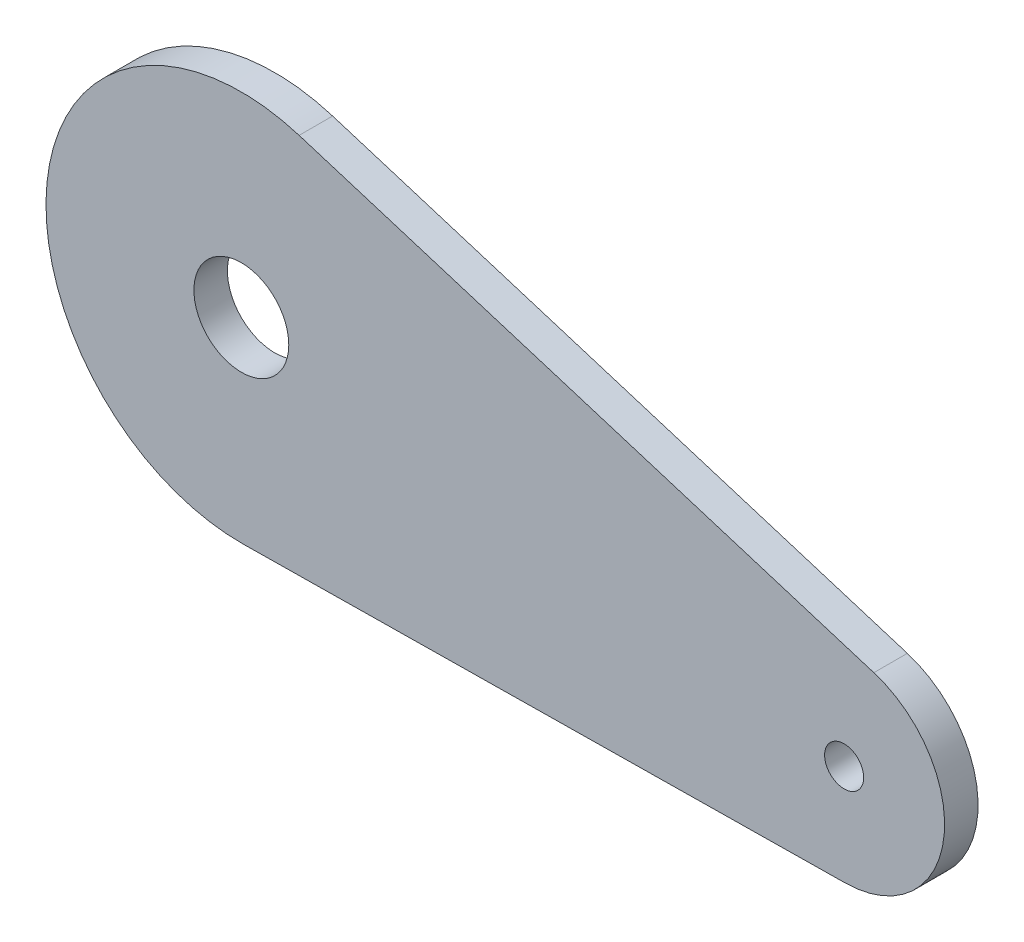
ISO-10303-21;
HEADER;
FILE_DESCRIPTION(('STEP AP214'),'2;1');
FILE_NAME('part.step','',(''),(''),'','','');
FILE_SCHEMA(('AUTOMOTIVE_DESIGN { 1 0 10303 214 1 1 1 1 }'));
ENDSEC;
DATA;
#1=APPLICATION_CONTEXT('core data for automotive mechanical design processes');
#2=APPLICATION_PROTOCOL_DEFINITION('international standard','automotive_design',2000,#1);
#3=PRODUCT_CONTEXT('',#1,'mechanical');
#4=PRODUCT('Part','Part','',(#3));
#5=PRODUCT_RELATED_PRODUCT_CATEGORY('part','',(#4));
#6=PRODUCT_DEFINITION_FORMATION('','',#4);
#7=PRODUCT_DEFINITION_CONTEXT('part definition',#1,'design');
#8=PRODUCT_DEFINITION('design','',#6,#7);
#9=PRODUCT_DEFINITION_SHAPE('','',#8);
#10=(LENGTH_UNIT() NAMED_UNIT(*) SI_UNIT(.MILLI.,.METRE.));
#11=(NAMED_UNIT(*) PLANE_ANGLE_UNIT() SI_UNIT($,.RADIAN.));
#12=(NAMED_UNIT(*) SI_UNIT($,.STERADIAN.) SOLID_ANGLE_UNIT());
#13=UNCERTAINTY_MEASURE_WITH_UNIT(LENGTH_MEASURE(1.E-05),#10,'distance_accuracy_value','');
#14=(GEOMETRIC_REPRESENTATION_CONTEXT(3) GLOBAL_UNCERTAINTY_ASSIGNED_CONTEXT((#13)) GLOBAL_UNIT_ASSIGNED_CONTEXT((#10,
#11,#12)) REPRESENTATION_CONTEXT('',''));
#15=CARTESIAN_POINT('',(0.,0.,0.));
#16=DIRECTION('',(0.,0.,1.));
#17=DIRECTION('',(1.,0.,0.));
#18=AXIS2_PLACEMENT_3D('',#15,#16,#17);
#19=CARTESIAN_POINT('',(-20.22,57.58,3.));
#20=DIRECTION('',(0.,0.,-1.));
#21=DIRECTION('',(-1.,0.,0.));
#22=AXIS2_PLACEMENT_3D('',#19,#20,#21);
#23=PLANE('',#22);
#24=CARTESIAN_POINT('',(-20.22,57.58,3.));
#25=DIRECTION('',(0.,0.,1.));
#26=DIRECTION('',(-1.,0.,0.));
#27=AXIS2_PLACEMENT_3D('',#24,#25,#26);
#28=CIRCLE('',#27,17.5);
#29=CARTESIAN_POINT('',(-15.0436132313808,74.2969082076102,3.));
#30=VERTEX_POINT('',#29);
#31=CARTESIAN_POINT('',(-20.0003733558261,40.0813782217808,3.));
#32=VERTEX_POINT('',#31);
#33=EDGE_CURVE('E85',#30,#32,#28,.T.);
#34=ORIENTED_EDGE('',*,*,#33,.T.);
#35=DIRECTION('',(0.999921244469671,0.0125500939527941,0.));
#36=VECTOR('',#35,1.);
#37=CARTESIAN_POINT('',(33.8929508455751,40.7577977757174,3.));
#38=LINE('',#37,#36);
#39=CARTESIAN_POINT('',(33.8929508455751,40.7577977757174,3.));
#40=VERTEX_POINT('',#39);
#41=EDGE_CURVE('E80',#32,#40,#38,.T.);
#42=ORIENTED_EDGE('',*,*,#41,.T.);
#43=CARTESIAN_POINT('',(33.78,49.7570889759445,3.));
#44=DIRECTION('',(0.,0.,1.));
#45=DIRECTION('',(-1.,0.,0.));
#46=AXIS2_PLACEMENT_3D('',#43,#44,#45);
#47=CIRCLE('',#46,9.);
#48=CARTESIAN_POINT('',(36.4421417667184,58.354356054144,3.));
#49=VERTEX_POINT('',#48);
#50=EDGE_CURVE('E83',#40,#49,#47,.T.);
#51=ORIENTED_EDGE('',*,*,#50,.T.);
#52=DIRECTION('',(-0.955251897577723,0.295793529635384,0.));
#53=VECTOR('',#52,1.);
#54=CARTESIAN_POINT('',(-15.0436132313808,74.2969082076102,3.));
#55=LINE('',#54,#53);
#56=EDGE_CURVE('E50',#49,#30,#55,.T.);
#57=ORIENTED_EDGE('',*,*,#56,.T.);
#58=EDGE_LOOP('',(#34,#42,#51,#57));
#59=FACE_BOUND('',#58,.T.);
#60=CARTESIAN_POINT('',(-20.22,57.58,3.));
#61=DIRECTION('',(0.,0.,1.));
#62=DIRECTION('',(1.,0.,0.));
#63=AXIS2_PLACEMENT_3D('',#60,#61,#62);
#64=CIRCLE('',#63,4.25);
#65=CARTESIAN_POINT('',(-15.97,57.58,3.));
#66=VERTEX_POINT('',#65);
#67=EDGE_CURVE('E100',#66,#66,#64,.T.);
#68=ORIENTED_EDGE('',*,*,#67,.F.);
#69=EDGE_LOOP('',(#68));
#70=FACE_BOUND('',#69,.T.);
#71=CARTESIAN_POINT('',(33.78,49.7570889759445,3.));
#72=DIRECTION('',(0.,0.,1.));
#73=DIRECTION('',(1.,0.,0.));
#74=AXIS2_PLACEMENT_3D('',#71,#72,#73);
#75=CIRCLE('',#74,1.75);
#76=CARTESIAN_POINT('',(35.53,49.7570889759445,3.));
#77=VERTEX_POINT('',#76);
#78=EDGE_CURVE('E115',#77,#77,#75,.T.);
#79=ORIENTED_EDGE('',*,*,#78,.F.);
#80=EDGE_LOOP('',(#79));
#81=FACE_BOUND('',#80,.T.);
#82=ADVANCED_FACE('F33',(#59,#70,#81),#23,.F.);
#83=CARTESIAN_POINT('',(-20.22,57.58,0.));
#84=DIRECTION('',(0.,0.,-1.));
#85=DIRECTION('',(-1.,0.,0.));
#86=AXIS2_PLACEMENT_3D('',#83,#84,#85);
#87=PLANE('',#86);
#88=CARTESIAN_POINT('',(-20.22,57.58,0.));
#89=DIRECTION('',(0.,0.,1.));
#90=DIRECTION('',(1.,0.,0.));
#91=AXIS2_PLACEMENT_3D('',#88,#89,#90);
#92=CIRCLE('',#91,4.25);
#93=CARTESIAN_POINT('',(-15.97,57.58,0.));
#94=VERTEX_POINT('',#93);
#95=EDGE_CURVE('E112',#94,#94,#92,.T.);
#96=ORIENTED_EDGE('',*,*,#95,.T.);
#97=EDGE_LOOP('',(#96));
#98=FACE_BOUND('',#97,.T.);
#99=CARTESIAN_POINT('',(-20.22,57.58,0.));
#100=DIRECTION('',(0.,0.,1.));
#101=DIRECTION('',(-1.,0.,0.));
#102=AXIS2_PLACEMENT_3D('',#99,#100,#101);
#103=CIRCLE('',#102,17.5);
#104=CARTESIAN_POINT('',(-15.0436132313808,74.2969082076102,0.));
#105=VERTEX_POINT('',#104);
#106=CARTESIAN_POINT('',(-20.0003733558261,40.0813782217808,0.));
#107=VERTEX_POINT('',#106);
#108=EDGE_CURVE('E97',#105,#107,#103,.T.);
#109=ORIENTED_EDGE('',*,*,#108,.F.);
#110=DIRECTION('',(-0.955251897577723,0.295793529635384,0.));
#111=VECTOR('',#110,1.);
#112=CARTESIAN_POINT('',(-15.0436132313808,74.2969082076102,0.));
#113=LINE('',#112,#111);
#114=CARTESIAN_POINT('',(36.4421417667184,58.354356054144,0.));
#115=VERTEX_POINT('',#114);
#116=EDGE_CURVE('E73',#115,#105,#113,.T.);
#117=ORIENTED_EDGE('',*,*,#116,.F.);
#118=CARTESIAN_POINT('',(33.78,49.7570889759445,0.));
#119=DIRECTION('',(0.,0.,1.));
#120=DIRECTION('',(-1.,0.,0.));
#121=AXIS2_PLACEMENT_3D('',#118,#119,#120);
#122=CIRCLE('',#121,9.);
#123=CARTESIAN_POINT('',(33.8929508455751,40.7577977757174,0.));
#124=VERTEX_POINT('',#123);
#125=EDGE_CURVE('E67',#124,#115,#122,.T.);
#126=ORIENTED_EDGE('',*,*,#125,.F.);
#127=DIRECTION('',(0.999921244469671,0.0125500939527941,0.));
#128=VECTOR('',#127,1.);
#129=CARTESIAN_POINT('',(33.8929508455751,40.7577977757174,0.));
#130=LINE('',#129,#128);
#131=EDGE_CURVE('E89',#107,#124,#130,.T.);
#132=ORIENTED_EDGE('',*,*,#131,.F.);
#133=EDGE_LOOP('',(#109,#117,#126,#132));
#134=FACE_BOUND('',#133,.T.);
#135=CARTESIAN_POINT('',(33.78,49.7570889759445,0.));
#136=DIRECTION('',(0.,0.,1.));
#137=DIRECTION('',(1.,0.,0.));
#138=AXIS2_PLACEMENT_3D('',#135,#136,#137);
#139=CIRCLE('',#138,1.75);
#140=CARTESIAN_POINT('',(35.53,49.7570889759445,0.));
#141=VERTEX_POINT('',#140);
#142=EDGE_CURVE('E118',#141,#141,#139,.T.);
#143=ORIENTED_EDGE('',*,*,#142,.T.);
#144=EDGE_LOOP('',(#143));
#145=FACE_BOUND('',#144,.T.);
#146=ADVANCED_FACE('F108',(#98,#134,#145),#87,.T.);
#147=CARTESIAN_POINT('',(-20.22,57.58,3.));
#148=DIRECTION('',(0.,0.,-1.));
#149=DIRECTION('',(-1.,0.,0.));
#150=AXIS2_PLACEMENT_3D('',#147,#148,#149);
#151=CYLINDRICAL_SURFACE('',#150,17.5);
#152=ORIENTED_EDGE('',*,*,#108,.T.);
#153=DIRECTION('',(0.,0.,-1.));
#154=VECTOR('',#153,1.);
#155=CARTESIAN_POINT('',(-20.0003733558261,40.0813782217808,3.));
#156=LINE('',#155,#154);
#157=EDGE_CURVE('E11',#32,#107,#156,.T.);
#158=ORIENTED_EDGE('',*,*,#157,.F.);
#159=ORIENTED_EDGE('',*,*,#33,.F.);
#160=DIRECTION('',(0.,0.,-1.));
#161=VECTOR('',#160,1.);
#162=CARTESIAN_POINT('',(-15.0436132313808,74.2969082076102,3.));
#163=LINE('',#162,#161);
#164=EDGE_CURVE('E93',#30,#105,#163,.T.);
#165=ORIENTED_EDGE('',*,*,#164,.T.);
#166=EDGE_LOOP('',(#152,#158,#159,#165));
#167=FACE_BOUND('',#166,.T.);
#168=ADVANCED_FACE('F35',(#167),#151,.T.);
#169=CARTESIAN_POINT('',(33.8929508455751,40.7577977757174,3.));
#170=DIRECTION('',(-0.0125500939527941,0.999921244469671,0.));
#171=DIRECTION('',(-0.999921244469671,-0.0125500939527941,0.));
#172=AXIS2_PLACEMENT_3D('',#169,#170,#171);
#173=PLANE('',#172);
#174=ORIENTED_EDGE('',*,*,#131,.T.);
#175=DIRECTION('',(0.,0.,-1.));
#176=VECTOR('',#175,1.);
#177=CARTESIAN_POINT('',(33.8929508455751,40.7577977757174,3.));
#178=LINE('',#177,#176);
#179=EDGE_CURVE('E42',#40,#124,#178,.T.);
#180=ORIENTED_EDGE('',*,*,#179,.F.);
#181=ORIENTED_EDGE('',*,*,#41,.F.);
#182=ORIENTED_EDGE('',*,*,#157,.T.);
#183=EDGE_LOOP('',(#174,#180,#181,#182));
#184=FACE_BOUND('',#183,.T.);
#185=ADVANCED_FACE('F88',(#184),#173,.F.);
#186=CARTESIAN_POINT('',(33.78,49.7570889759445,3.));
#187=DIRECTION('',(0.,0.,-1.));
#188=DIRECTION('',(-1.,0.,0.));
#189=AXIS2_PLACEMENT_3D('',#186,#187,#188);
#190=CYLINDRICAL_SURFACE('',#189,9.);
#191=ORIENTED_EDGE('',*,*,#125,.T.);
#192=DIRECTION('',(0.,0.,-1.));
#193=VECTOR('',#192,1.);
#194=CARTESIAN_POINT('',(36.4421417667184,58.354356054144,3.));
#195=LINE('',#194,#193);
#196=EDGE_CURVE('E90',#49,#115,#195,.T.);
#197=ORIENTED_EDGE('',*,*,#196,.F.);
#198=ORIENTED_EDGE('',*,*,#50,.F.);
#199=ORIENTED_EDGE('',*,*,#179,.T.);
#200=EDGE_LOOP('',(#191,#197,#198,#199));
#201=FACE_BOUND('',#200,.T.);
#202=ADVANCED_FACE('F91',(#201),#190,.T.);
#203=CARTESIAN_POINT('',(-15.0436132313808,74.2969082076102,3.));
#204=DIRECTION('',(-0.295793529635384,-0.955251897577723,0.));
#205=DIRECTION('',(0.955251897577723,-0.295793529635384,0.));
#206=AXIS2_PLACEMENT_3D('',#203,#204,#205);
#207=PLANE('',#206);
#208=ORIENTED_EDGE('',*,*,#116,.T.);
#209=ORIENTED_EDGE('',*,*,#164,.F.);
#210=ORIENTED_EDGE('',*,*,#56,.F.);
#211=ORIENTED_EDGE('',*,*,#196,.T.);
#212=EDGE_LOOP('',(#208,#209,#210,#211));
#213=FACE_BOUND('',#212,.T.);
#214=ADVANCED_FACE('F105',(#213),#207,.F.);
#215=CARTESIAN_POINT('',(-20.22,57.58,3.));
#216=DIRECTION('',(0.,0.,-1.));
#217=DIRECTION('',(-1.,0.,0.));
#218=AXIS2_PLACEMENT_3D('',#215,#216,#217);
#219=CYLINDRICAL_SURFACE('',#218,4.25);
#220=ORIENTED_EDGE('',*,*,#67,.T.);
#221=EDGE_LOOP('',(#220));
#222=FACE_BOUND('',#221,.T.);
#223=ORIENTED_EDGE('',*,*,#95,.F.);
#224=EDGE_LOOP('',(#223));
#225=FACE_BOUND('',#224,.T.);
#226=ADVANCED_FACE('F135',(#222,#225),#219,.F.);
#227=CARTESIAN_POINT('',(33.78,49.7570889759445,3.));
#228=DIRECTION('',(0.,0.,-1.));
#229=DIRECTION('',(-1.,0.,0.));
#230=AXIS2_PLACEMENT_3D('',#227,#228,#229);
#231=CYLINDRICAL_SURFACE('',#230,1.75);
#232=ORIENTED_EDGE('',*,*,#78,.T.);
#233=EDGE_LOOP('',(#232));
#234=FACE_BOUND('',#233,.T.);
#235=ORIENTED_EDGE('',*,*,#142,.F.);
#236=EDGE_LOOP('',(#235));
#237=FACE_BOUND('',#236,.T.);
#238=ADVANCED_FACE('F124',(#234,#237),#231,.F.);
#239=CLOSED_SHELL('',(#82,#146,#168,#185,#202,#214,#226,#238));
#240=MANIFOLD_SOLID_BREP('B2',#239);
#241=ADVANCED_BREP_SHAPE_REPRESENTATION('',(#18,#240),#14);
#242=SHAPE_DEFINITION_REPRESENTATION(#9,#241);
ENDSEC;
END-ISO-10303-21;
